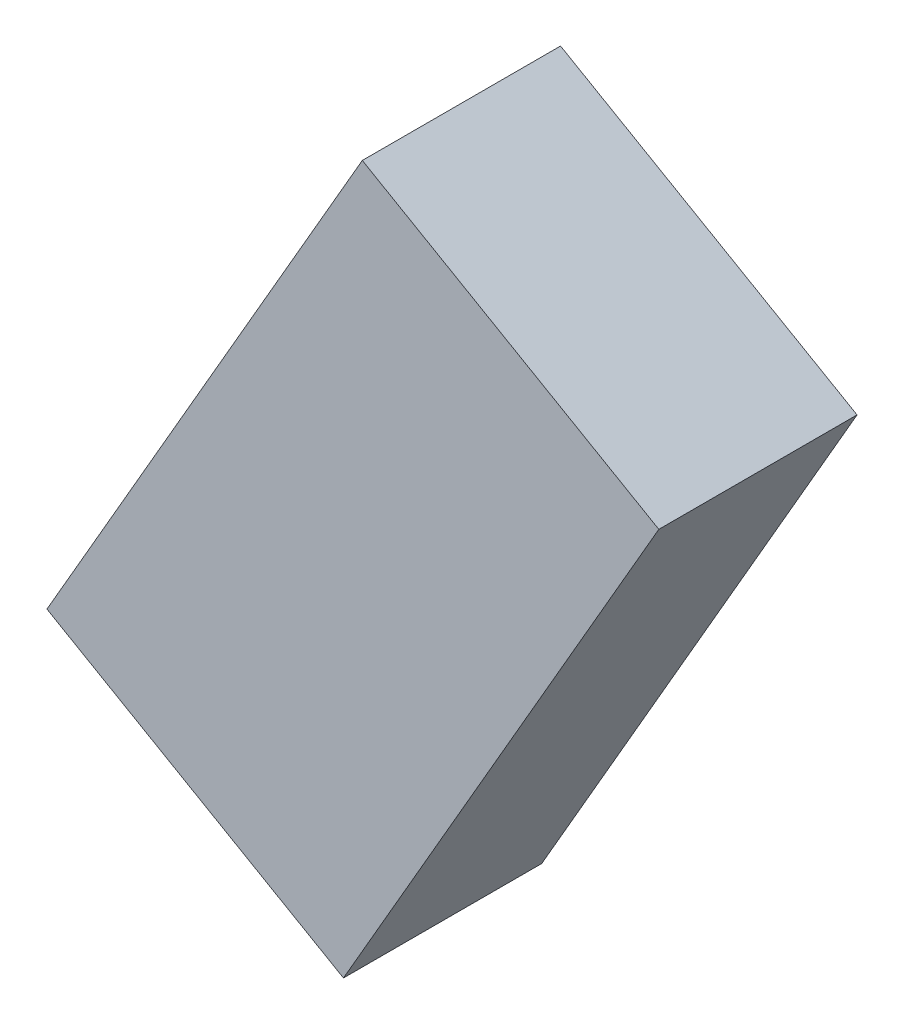
ISO-10303-21;
HEADER;
FILE_DESCRIPTION(('STEP AP214'),'2;1');
FILE_NAME('part.step','',(''),(''),'','','');
FILE_SCHEMA(('AUTOMOTIVE_DESIGN { 1 0 10303 214 1 1 1 1 }'));
ENDSEC;
DATA;
#1=APPLICATION_CONTEXT('core data for automotive mechanical design processes');
#2=APPLICATION_PROTOCOL_DEFINITION('international standard','automotive_design',2000,#1);
#3=PRODUCT_CONTEXT('',#1,'mechanical');
#4=PRODUCT('Part','Part','',(#3));
#5=PRODUCT_RELATED_PRODUCT_CATEGORY('part','',(#4));
#6=PRODUCT_DEFINITION_FORMATION('','',#4);
#7=PRODUCT_DEFINITION_CONTEXT('part definition',#1,'design');
#8=PRODUCT_DEFINITION('design','',#6,#7);
#9=PRODUCT_DEFINITION_SHAPE('','',#8);
#10=(LENGTH_UNIT() NAMED_UNIT(*) SI_UNIT(.MILLI.,.METRE.));
#11=(NAMED_UNIT(*) PLANE_ANGLE_UNIT() SI_UNIT($,.RADIAN.));
#12=(NAMED_UNIT(*) SI_UNIT($,.STERADIAN.) SOLID_ANGLE_UNIT());
#13=UNCERTAINTY_MEASURE_WITH_UNIT(LENGTH_MEASURE(1.E-05),#10,'distance_accuracy_value','');
#14=(GEOMETRIC_REPRESENTATION_CONTEXT(3) GLOBAL_UNCERTAINTY_ASSIGNED_CONTEXT((#13)) GLOBAL_UNIT_ASSIGNED_CONTEXT((#10,
#11,#12)) REPRESENTATION_CONTEXT('',''));
#15=CARTESIAN_POINT('',(0.,0.,0.));
#16=DIRECTION('',(0.,0.,1.));
#17=DIRECTION('',(1.,0.,0.));
#18=AXIS2_PLACEMENT_3D('',#15,#16,#17);
#19=CARTESIAN_POINT('',(-0.0261366,-0.99527106,0.5499989));
#20=DIRECTION('',(0.,0.,-1.));
#21=DIRECTION('',(-1.,0.,0.));
#22=AXIS2_PLACEMENT_3D('',#19,#20,#21);
#23=PLANE('',#22);
#24=DIRECTION('',(0.86602583329618,-0.499999256063104,0.));
#25=VECTOR('',#24,1.);
#26=CARTESIAN_POINT('',(0.84886292,0.52027328,0.5499989));
#27=LINE('',#26,#25);
#28=CARTESIAN_POINT('',(0.848862919999941,0.520273280000034,0.5499989));
#29=VERTEX_POINT('',#28);
#30=CARTESIAN_POINT('',(0.0261365999999478,0.99527359999991,0.5499989));
#31=VERTEX_POINT('',#30);
#32=EDGE_CURVE('E54',#29,#31,#27,.F.);
#33=ORIENTED_EDGE('',*,*,#32,.T.);
#34=DIRECTION('',(0.499998734569058,0.866026134380101,0.));
#35=VECTOR('',#34,1.);
#36=CARTESIAN_POINT('',(0.0261366,0.9952736,0.5499989));
#37=LINE('',#36,#35);
#38=CARTESIAN_POINT('',(-0.848860379999921,-0.520270740000045,0.5499989));
#39=VERTEX_POINT('',#38);
#40=EDGE_CURVE('E56',#31,#39,#37,.F.);
#41=ORIENTED_EDGE('',*,*,#40,.T.);
#42=DIRECTION('',(-0.866025164876141,0.500000413801082,0.));
#43=VECTOR('',#42,1.);
#44=CARTESIAN_POINT('',(-0.84886038,-0.52027074,0.5499989));
#45=LINE('',#44,#43);
#46=CARTESIAN_POINT('',(-0.0261365999999425,-0.995271059999901,0.5499989));
#47=VERTEX_POINT('',#46);
#48=EDGE_CURVE('E19',#39,#47,#45,.F.);
#49=ORIENTED_EDGE('',*,*,#48,.T.);
#50=DIRECTION('',(-0.499999823142186,-0.866025505893321,0.));
#51=VECTOR('',#50,1.);
#52=CARTESIAN_POINT('',(-0.0261366,-0.99527106,0.5499989));
#53=LINE('',#52,#51);
#54=EDGE_CURVE('E79',#47,#29,#53,.F.);
#55=ORIENTED_EDGE('',*,*,#54,.T.);
#56=EDGE_LOOP('',(#33,#41,#49,#55));
#57=FACE_BOUND('',#56,.T.);
#58=ADVANCED_FACE('F16',(#57),#23,.F.);
#59=CARTESIAN_POINT('',(-0.84886038,-0.52027074,0.));
#60=DIRECTION('',(0.500000413801082,0.866025164876141,0.));
#61=DIRECTION('',(-0.866025164876141,0.500000413801082,0.));
#62=AXIS2_PLACEMENT_3D('',#59,#60,#61);
#63=PLANE('',#62);
#64=DIRECTION('',(0.,0.,1.));
#65=VECTOR('',#64,1.);
#66=CARTESIAN_POINT('',(-0.0261366,-0.99527106,0.));
#67=LINE('',#66,#65);
#68=CARTESIAN_POINT('',(-0.0261365999999425,-0.995271059999901,0.));
#69=VERTEX_POINT('',#68);
#70=EDGE_CURVE('E67',#69,#47,#67,.T.);
#71=ORIENTED_EDGE('',*,*,#70,.T.);
#72=ORIENTED_EDGE('',*,*,#48,.F.);
#73=DIRECTION('',(0.,0.,1.));
#74=VECTOR('',#73,1.);
#75=CARTESIAN_POINT('',(-0.848860379999685,-0.520270740000182,0.));
#76=LINE('',#75,#74);
#77=CARTESIAN_POINT('',(-0.848860379999921,-0.520270740000045,0.));
#78=VERTEX_POINT('',#77);
#79=EDGE_CURVE('E62',#39,#78,#76,.F.);
#80=ORIENTED_EDGE('',*,*,#79,.T.);
#81=DIRECTION('',(-0.86602516487602,0.500000413801291,0.));
#82=VECTOR('',#81,1.);
#83=CARTESIAN_POINT('',(-0.0261366,-0.99527106,0.));
#84=LINE('',#83,#82);
#85=EDGE_CURVE('E82',#69,#78,#84,.T.);
#86=ORIENTED_EDGE('',*,*,#85,.F.);
#87=EDGE_LOOP('',(#71,#72,#80,#86));
#88=FACE_BOUND('',#87,.T.);
#89=ADVANCED_FACE('F64',(#88),#63,.F.);
#90=CARTESIAN_POINT('',(0.0261366,0.9952736,0.));
#91=DIRECTION('',(0.866026134380101,-0.499998734569058,0.));
#92=DIRECTION('',(0.499998734569058,0.866026134380101,0.));
#93=AXIS2_PLACEMENT_3D('',#90,#91,#92);
#94=PLANE('',#93);
#95=ORIENTED_EDGE('',*,*,#79,.F.);
#96=ORIENTED_EDGE('',*,*,#40,.F.);
#97=DIRECTION('',(0.,0.,1.));
#98=VECTOR('',#97,1.);
#99=CARTESIAN_POINT('',(0.0261365999997913,0.995273599999639,0.));
#100=LINE('',#99,#98);
#101=CARTESIAN_POINT('',(0.0261365999999478,0.99527359999991,0.));
#102=VERTEX_POINT('',#101);
#103=EDGE_CURVE('E74',#31,#102,#100,.F.);
#104=ORIENTED_EDGE('',*,*,#103,.T.);
#105=DIRECTION('',(0.499998734569238,0.866026134379997,0.));
#106=VECTOR('',#105,1.);
#107=CARTESIAN_POINT('',(-0.84886038,-0.52027074,0.));
#108=LINE('',#107,#106);
#109=EDGE_CURVE('E71',#78,#102,#108,.T.);
#110=ORIENTED_EDGE('',*,*,#109,.F.);
#111=EDGE_LOOP('',(#95,#96,#104,#110));
#112=FACE_BOUND('',#111,.T.);
#113=ADVANCED_FACE('F69',(#112),#94,.F.);
#114=CARTESIAN_POINT('',(0.84886292,0.52027328,0.));
#115=DIRECTION('',(-0.499999256063104,-0.86602583329618,0.));
#116=DIRECTION('',(0.86602583329618,-0.499999256063104,0.));
#117=AXIS2_PLACEMENT_3D('',#114,#115,#116);
#118=PLANE('',#117);
#119=ORIENTED_EDGE('',*,*,#103,.F.);
#120=ORIENTED_EDGE('',*,*,#32,.F.);
#121=DIRECTION('',(0.,0.,1.));
#122=VECTOR('',#121,1.);
#123=CARTESIAN_POINT('',(0.848862919999764,0.520273280000137,0.));
#124=LINE('',#123,#122);
#125=CARTESIAN_POINT('',(0.848862919999941,0.520273280000034,0.));
#126=VERTEX_POINT('',#125);
#127=EDGE_CURVE('E34',#29,#126,#124,.F.);
#128=ORIENTED_EDGE('',*,*,#127,.T.);
#129=DIRECTION('',(0.86602583329596,-0.499999256063484,0.));
#130=VECTOR('',#129,1.);
#131=CARTESIAN_POINT('',(0.0261366,0.9952736,0.));
#132=LINE('',#131,#130);
#133=EDGE_CURVE('E25',#102,#126,#132,.T.);
#134=ORIENTED_EDGE('',*,*,#133,.F.);
#135=EDGE_LOOP('',(#119,#120,#128,#134));
#136=FACE_BOUND('',#135,.T.);
#137=ADVANCED_FACE('F88',(#136),#118,.F.);
#138=CARTESIAN_POINT('',(-0.0261366,-0.99527106,0.));
#139=DIRECTION('',(-0.866025505893321,0.499999823142186,0.));
#140=DIRECTION('',(-0.499999823142186,-0.866025505893321,0.));
#141=AXIS2_PLACEMENT_3D('',#138,#139,#140);
#142=PLANE('',#141);
#143=ORIENTED_EDGE('',*,*,#127,.F.);
#144=ORIENTED_EDGE('',*,*,#54,.F.);
#145=ORIENTED_EDGE('',*,*,#70,.F.);
#146=DIRECTION('',(-0.499999823142321,-0.866025505893243,0.));
#147=VECTOR('',#146,1.);
#148=CARTESIAN_POINT('',(0.84886292,0.52027328,0.));
#149=LINE('',#148,#147);
#150=EDGE_CURVE('E11',#126,#69,#149,.T.);
#151=ORIENTED_EDGE('',*,*,#150,.F.);
#152=EDGE_LOOP('',(#143,#144,#145,#151));
#153=FACE_BOUND('',#152,.T.);
#154=ADVANCED_FACE('F90',(#153),#142,.F.);
#155=CARTESIAN_POINT('',(-0.0261366,-0.99527106,0.));
#156=DIRECTION('',(0.,0.,-1.));
#157=DIRECTION('',(-1.,0.,0.));
#158=AXIS2_PLACEMENT_3D('',#155,#156,#157);
#159=PLANE('',#158);
#160=ORIENTED_EDGE('',*,*,#133,.T.);
#161=ORIENTED_EDGE('',*,*,#150,.T.);
#162=ORIENTED_EDGE('',*,*,#85,.T.);
#163=ORIENTED_EDGE('',*,*,#109,.T.);
#164=EDGE_LOOP('',(#160,#161,#162,#163));
#165=FACE_BOUND('',#164,.T.);
#166=ADVANCED_FACE('F87',(#165),#159,.T.);
#167=CLOSED_SHELL('',(#58,#89,#113,#137,#154,#166));
#168=MANIFOLD_SOLID_BREP('B1',#167);
#169=ADVANCED_BREP_SHAPE_REPRESENTATION('',(#18,#168),#14);
#170=SHAPE_DEFINITION_REPRESENTATION(#9,#169);
ENDSEC;
END-ISO-10303-21;
